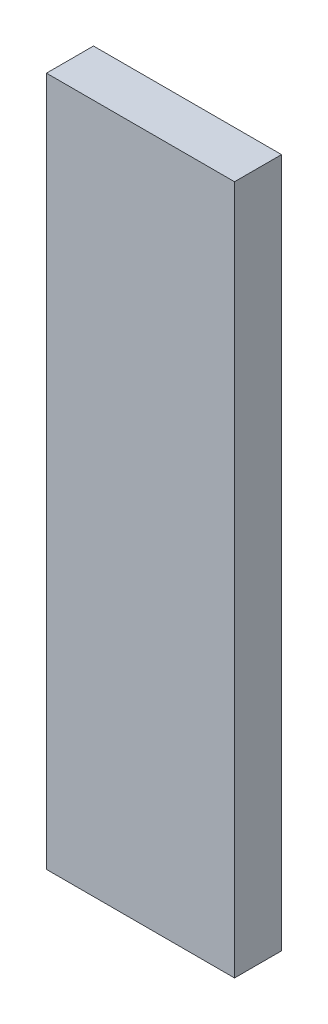
ISO-10303-21;
HEADER;
FILE_DESCRIPTION(('STEP AP214'),'2;1');
FILE_NAME('part.step','',(''),(''),'','','');
FILE_SCHEMA(('AUTOMOTIVE_DESIGN { 1 0 10303 214 1 1 1 1 }'));
ENDSEC;
DATA;
#1=APPLICATION_CONTEXT('core data for automotive mechanical design processes');
#2=APPLICATION_PROTOCOL_DEFINITION('international standard','automotive_design',2000,#1);
#3=PRODUCT_CONTEXT('',#1,'mechanical');
#4=PRODUCT('Part','Part','',(#3));
#5=PRODUCT_RELATED_PRODUCT_CATEGORY('part','',(#4));
#6=PRODUCT_DEFINITION_FORMATION('','',#4);
#7=PRODUCT_DEFINITION_CONTEXT('part definition',#1,'design');
#8=PRODUCT_DEFINITION('design','',#6,#7);
#9=PRODUCT_DEFINITION_SHAPE('','',#8);
#10=(LENGTH_UNIT() NAMED_UNIT(*) SI_UNIT(.MILLI.,.METRE.));
#11=(NAMED_UNIT(*) PLANE_ANGLE_UNIT() SI_UNIT($,.RADIAN.));
#12=(NAMED_UNIT(*) SI_UNIT($,.STERADIAN.) SOLID_ANGLE_UNIT());
#13=UNCERTAINTY_MEASURE_WITH_UNIT(LENGTH_MEASURE(1.E-05),#10,'distance_accuracy_value','');
#14=(GEOMETRIC_REPRESENTATION_CONTEXT(3) GLOBAL_UNCERTAINTY_ASSIGNED_CONTEXT((#13)) GLOBAL_UNIT_ASSIGNED_CONTEXT((#10,
#11,#12)) REPRESENTATION_CONTEXT('',''));
#15=CARTESIAN_POINT('',(0.,0.,0.));
#16=DIRECTION('',(0.,0.,1.));
#17=DIRECTION('',(1.,0.,0.));
#18=AXIS2_PLACEMENT_3D('',#15,#16,#17);
#19=CARTESIAN_POINT('',(32.,22.,5.));
#20=DIRECTION('',(0.,0.,-1.));
#21=DIRECTION('',(-1.,0.,0.));
#22=AXIS2_PLACEMENT_3D('',#19,#20,#21);
#23=PLANE('',#22);
#24=DIRECTION('',(0.,1.,0.));
#25=VECTOR('',#24,1.);
#26=CARTESIAN_POINT('',(20.,22.,5.));
#27=LINE('',#26,#25);
#28=CARTESIAN_POINT('',(20.,22.,5.));
#29=VERTEX_POINT('',#28);
#30=CARTESIAN_POINT('',(20.,-22.,5.));
#31=VERTEX_POINT('',#30);
#32=EDGE_CURVE('E55',#29,#31,#27,.F.);
#33=ORIENTED_EDGE('',*,*,#32,.T.);
#34=DIRECTION('',(1.,0.,0.));
#35=VECTOR('',#34,1.);
#36=CARTESIAN_POINT('',(20.,-22.,5.));
#37=LINE('',#36,#35);
#38=CARTESIAN_POINT('',(32.,-22.,5.));
#39=VERTEX_POINT('',#38);
#40=EDGE_CURVE('E57',#31,#39,#37,.T.);
#41=ORIENTED_EDGE('',*,*,#40,.T.);
#42=DIRECTION('',(0.,1.,0.));
#43=VECTOR('',#42,1.);
#44=CARTESIAN_POINT('',(32.,-22.,5.));
#45=LINE('',#44,#43);
#46=CARTESIAN_POINT('',(32.,22.,5.));
#47=VERTEX_POINT('',#46);
#48=EDGE_CURVE('E20',#39,#47,#45,.T.);
#49=ORIENTED_EDGE('',*,*,#48,.T.);
#50=DIRECTION('',(1.,0.,0.));
#51=VECTOR('',#50,1.);
#52=CARTESIAN_POINT('',(32.,22.,5.));
#53=LINE('',#52,#51);
#54=EDGE_CURVE('E80',#47,#29,#53,.F.);
#55=ORIENTED_EDGE('',*,*,#54,.T.);
#56=EDGE_LOOP('',(#33,#41,#49,#55));
#57=FACE_BOUND('',#56,.T.);
#58=ADVANCED_FACE('F17',(#57),#23,.F.);
#59=CARTESIAN_POINT('',(32.,-22.,2.));
#60=DIRECTION('',(-1.,0.,0.));
#61=DIRECTION('',(0.,0.,1.));
#62=AXIS2_PLACEMENT_3D('',#59,#60,#61);
#63=PLANE('',#62);
#64=DIRECTION('',(0.,0.,-1.));
#65=VECTOR('',#64,1.);
#66=CARTESIAN_POINT('',(32.,22.,2.));
#67=LINE('',#66,#65);
#68=CARTESIAN_POINT('',(32.,22.,2.));
#69=VERTEX_POINT('',#68);
#70=EDGE_CURVE('E68',#69,#47,#67,.F.);
#71=ORIENTED_EDGE('',*,*,#70,.T.);
#72=ORIENTED_EDGE('',*,*,#48,.F.);
#73=DIRECTION('',(0.,0.,1.));
#74=VECTOR('',#73,1.);
#75=CARTESIAN_POINT('',(32.,-22.,2.));
#76=LINE('',#75,#74);
#77=CARTESIAN_POINT('',(32.,-22.,2.));
#78=VERTEX_POINT('',#77);
#79=EDGE_CURVE('E63',#39,#78,#76,.F.);
#80=ORIENTED_EDGE('',*,*,#79,.T.);
#81=DIRECTION('',(0.,1.,0.));
#82=VECTOR('',#81,1.);
#83=CARTESIAN_POINT('',(32.,22.,2.));
#84=LINE('',#83,#82);
#85=EDGE_CURVE('E83',#69,#78,#84,.F.);
#86=ORIENTED_EDGE('',*,*,#85,.F.);
#87=EDGE_LOOP('',(#71,#72,#80,#86));
#88=FACE_BOUND('',#87,.T.);
#89=ADVANCED_FACE('F65',(#88),#63,.F.);
#90=CARTESIAN_POINT('',(20.,-22.,2.));
#91=DIRECTION('',(0.,1.,0.));
#92=DIRECTION('',(0.,0.,1.));
#93=AXIS2_PLACEMENT_3D('',#90,#91,#92);
#94=PLANE('',#93);
#95=ORIENTED_EDGE('',*,*,#79,.F.);
#96=ORIENTED_EDGE('',*,*,#40,.F.);
#97=DIRECTION('',(0.,0.,-1.));
#98=VECTOR('',#97,1.);
#99=CARTESIAN_POINT('',(20.,-22.,2.));
#100=LINE('',#99,#98);
#101=CARTESIAN_POINT('',(20.,-22.,2.));
#102=VERTEX_POINT('',#101);
#103=EDGE_CURVE('E75',#31,#102,#100,.T.);
#104=ORIENTED_EDGE('',*,*,#103,.T.);
#105=DIRECTION('',(-1.,0.,0.));
#106=VECTOR('',#105,1.);
#107=CARTESIAN_POINT('',(32.,-22.,2.));
#108=LINE('',#107,#106);
#109=EDGE_CURVE('E72',#78,#102,#108,.T.);
#110=ORIENTED_EDGE('',*,*,#109,.F.);
#111=EDGE_LOOP('',(#95,#96,#104,#110));
#112=FACE_BOUND('',#111,.T.);
#113=ADVANCED_FACE('F70',(#112),#94,.F.);
#114=CARTESIAN_POINT('',(20.,22.,2.));
#115=DIRECTION('',(1.,0.,0.));
#116=DIRECTION('',(0.,0.,-1.));
#117=AXIS2_PLACEMENT_3D('',#114,#115,#116);
#118=PLANE('',#117);
#119=ORIENTED_EDGE('',*,*,#103,.F.);
#120=ORIENTED_EDGE('',*,*,#32,.F.);
#121=DIRECTION('',(0.,0.,-1.));
#122=VECTOR('',#121,1.);
#123=CARTESIAN_POINT('',(20.,22.,2.));
#124=LINE('',#123,#122);
#125=CARTESIAN_POINT('',(20.,22.,2.));
#126=VERTEX_POINT('',#125);
#127=EDGE_CURVE('E35',#29,#126,#124,.T.);
#128=ORIENTED_EDGE('',*,*,#127,.T.);
#129=DIRECTION('',(0.,1.,0.));
#130=VECTOR('',#129,1.);
#131=CARTESIAN_POINT('',(20.,22.,2.));
#132=LINE('',#131,#130);
#133=EDGE_CURVE('E26',#102,#126,#132,.T.);
#134=ORIENTED_EDGE('',*,*,#133,.F.);
#135=EDGE_LOOP('',(#119,#120,#128,#134));
#136=FACE_BOUND('',#135,.T.);
#137=ADVANCED_FACE('F89',(#136),#118,.F.);
#138=CARTESIAN_POINT('',(32.,22.,2.));
#139=DIRECTION('',(0.,-1.,0.));
#140=DIRECTION('',(0.,0.,-1.));
#141=AXIS2_PLACEMENT_3D('',#138,#139,#140);
#142=PLANE('',#141);
#143=ORIENTED_EDGE('',*,*,#127,.F.);
#144=ORIENTED_EDGE('',*,*,#54,.F.);
#145=ORIENTED_EDGE('',*,*,#70,.F.);
#146=DIRECTION('',(-1.,0.,0.));
#147=VECTOR('',#146,1.);
#148=CARTESIAN_POINT('',(32.,22.,2.));
#149=LINE('',#148,#147);
#150=EDGE_CURVE('E11',#126,#69,#149,.F.);
#151=ORIENTED_EDGE('',*,*,#150,.F.);
#152=EDGE_LOOP('',(#143,#144,#145,#151));
#153=FACE_BOUND('',#152,.T.);
#154=ADVANCED_FACE('F91',(#153),#142,.F.);
#155=CARTESIAN_POINT('',(32.,22.,2.));
#156=DIRECTION('',(0.,0.,-1.));
#157=DIRECTION('',(-1.,0.,0.));
#158=AXIS2_PLACEMENT_3D('',#155,#156,#157);
#159=PLANE('',#158);
#160=ORIENTED_EDGE('',*,*,#133,.T.);
#161=ORIENTED_EDGE('',*,*,#150,.T.);
#162=ORIENTED_EDGE('',*,*,#85,.T.);
#163=ORIENTED_EDGE('',*,*,#109,.T.);
#164=EDGE_LOOP('',(#160,#161,#162,#163));
#165=FACE_BOUND('',#164,.T.);
#166=ADVANCED_FACE('F88',(#165),#159,.T.);
#167=CLOSED_SHELL('',(#58,#89,#113,#137,#154,#166));
#168=MANIFOLD_SOLID_BREP('B1',#167);
#169=ADVANCED_BREP_SHAPE_REPRESENTATION('',(#18,#168),#14);
#170=SHAPE_DEFINITION_REPRESENTATION(#9,#169);
ENDSEC;
END-ISO-10303-21;
